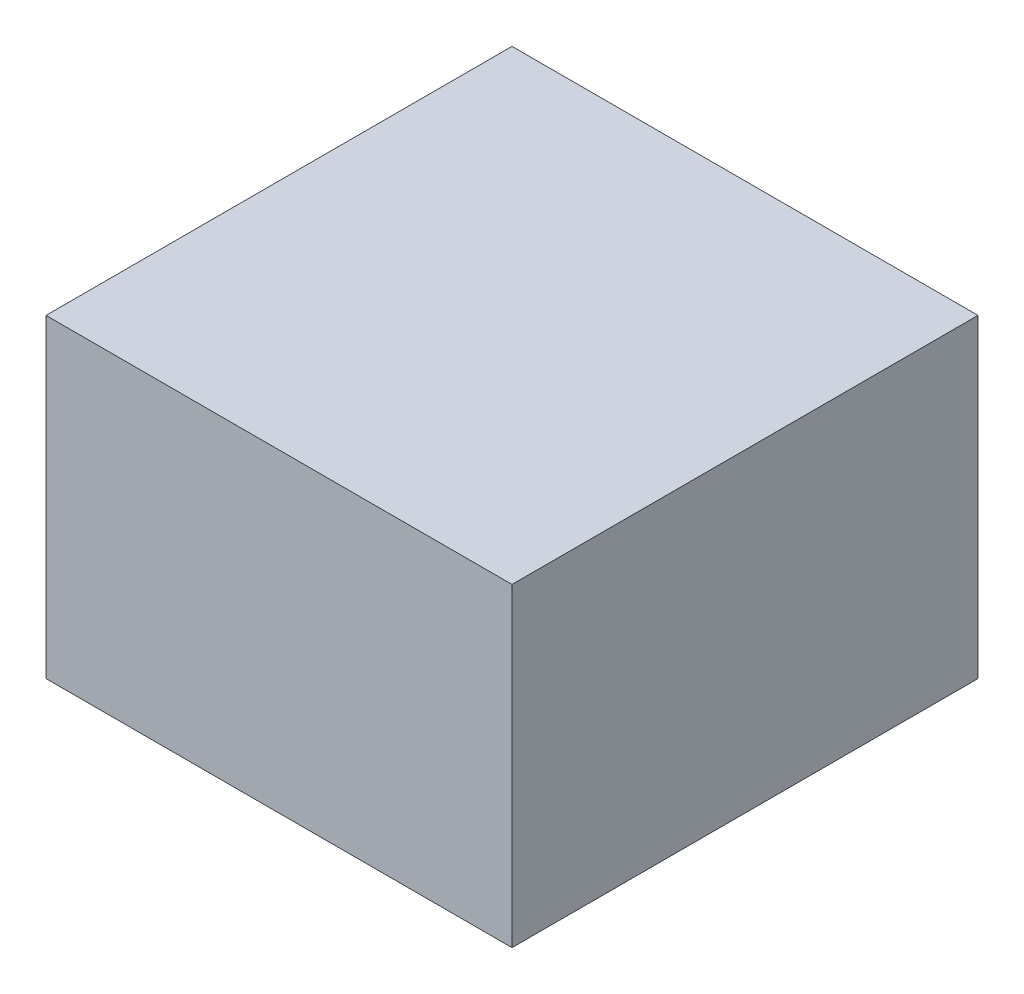
ISO-10303-21;
HEADER;
FILE_DESCRIPTION(('STEP AP214'),'2;1');
FILE_NAME('part.step','',(''),(''),'','','');
FILE_SCHEMA(('AUTOMOTIVE_DESIGN { 1 0 10303 214 1 1 1 1 }'));
ENDSEC;
DATA;
#1=APPLICATION_CONTEXT('core data for automotive mechanical design processes');
#2=APPLICATION_PROTOCOL_DEFINITION('international standard','automotive_design',2000,#1);
#3=PRODUCT_CONTEXT('',#1,'mechanical');
#4=PRODUCT('Part','Part','',(#3));
#5=PRODUCT_RELATED_PRODUCT_CATEGORY('part','',(#4));
#6=PRODUCT_DEFINITION_FORMATION('','',#4);
#7=PRODUCT_DEFINITION_CONTEXT('part definition',#1,'design');
#8=PRODUCT_DEFINITION('design','',#6,#7);
#9=PRODUCT_DEFINITION_SHAPE('','',#8);
#10=(LENGTH_UNIT() NAMED_UNIT(*) SI_UNIT(.MILLI.,.METRE.));
#11=(NAMED_UNIT(*) PLANE_ANGLE_UNIT() SI_UNIT($,.RADIAN.));
#12=(NAMED_UNIT(*) SI_UNIT($,.STERADIAN.) SOLID_ANGLE_UNIT());
#13=UNCERTAINTY_MEASURE_WITH_UNIT(LENGTH_MEASURE(1.E-05),#10,'distance_accuracy_value','');
#14=(GEOMETRIC_REPRESENTATION_CONTEXT(3) GLOBAL_UNCERTAINTY_ASSIGNED_CONTEXT((#13)) GLOBAL_UNIT_ASSIGNED_CONTEXT((#10,
#11,#12)) REPRESENTATION_CONTEXT('',''));
#15=CARTESIAN_POINT('',(0.,0.,0.));
#16=DIRECTION('',(0.,0.,1.));
#17=DIRECTION('',(1.,0.,0.));
#18=AXIS2_PLACEMENT_3D('',#15,#16,#17);
#19=CARTESIAN_POINT('',(-17.3023255813953,27.,-18.7906976744186));
#20=DIRECTION('',(1.,0.,0.));
#21=DIRECTION('',(0.,0.,-1.));
#22=AXIS2_PLACEMENT_3D('',#19,#20,#21);
#23=PLANE('',#22);
#24=DIRECTION('',(0.,0.,1.));
#25=VECTOR('',#24,1.);
#26=CARTESIAN_POINT('',(-17.3023255813953,0.,-18.7906976744186));
#27=LINE('',#26,#25);
#28=CARTESIAN_POINT('',(-17.3023255813953,0.,-18.7906976744186));
#29=VERTEX_POINT('',#28);
#30=CARTESIAN_POINT('',(-17.3023255813953,0.,21.2093023255814));
#31=VERTEX_POINT('',#30);
#32=EDGE_CURVE('E96',#29,#31,#27,.T.);
#33=ORIENTED_EDGE('',*,*,#32,.T.);
#34=DIRECTION('',(0.,-1.,0.));
#35=VECTOR('',#34,1.);
#36=CARTESIAN_POINT('',(-17.3023255813953,27.,21.2093023255814));
#37=LINE('',#36,#35);
#38=CARTESIAN_POINT('',(-17.3023255813953,27.,21.2093023255814));
#39=VERTEX_POINT('',#38);
#40=EDGE_CURVE('E11',#39,#31,#37,.T.);
#41=ORIENTED_EDGE('',*,*,#40,.F.);
#42=DIRECTION('',(0.,0.,1.));
#43=VECTOR('',#42,1.);
#44=CARTESIAN_POINT('',(-17.3023255813953,27.,-18.7906976744186));
#45=LINE('',#44,#43);
#46=CARTESIAN_POINT('',(-17.3023255813953,27.,-18.7906976744186));
#47=VERTEX_POINT('',#46);
#48=EDGE_CURVE('E84',#47,#39,#45,.T.);
#49=ORIENTED_EDGE('',*,*,#48,.F.);
#50=DIRECTION('',(0.,-1.,0.));
#51=VECTOR('',#50,1.);
#52=CARTESIAN_POINT('',(-17.3023255813953,27.,-18.7906976744186));
#53=LINE('',#52,#51);
#54=EDGE_CURVE('E92',#47,#29,#53,.T.);
#55=ORIENTED_EDGE('',*,*,#54,.T.);
#56=EDGE_LOOP('',(#33,#41,#49,#55));
#57=FACE_BOUND('',#56,.T.);
#58=ADVANCED_FACE('F33',(#57),#23,.F.);
#59=CARTESIAN_POINT('',(-17.3023255813953,27.,21.2093023255814));
#60=DIRECTION('',(0.,0.,-1.));
#61=DIRECTION('',(-1.,0.,0.));
#62=AXIS2_PLACEMENT_3D('',#59,#60,#61);
#63=PLANE('',#62);
#64=DIRECTION('',(1.,0.,0.));
#65=VECTOR('',#64,1.);
#66=CARTESIAN_POINT('',(-17.3023255813953,0.,21.2093023255814));
#67=LINE('',#66,#65);
#68=CARTESIAN_POINT('',(22.6976744186047,0.,21.2093023255814));
#69=VERTEX_POINT('',#68);
#70=EDGE_CURVE('E88',#31,#69,#67,.T.);
#71=ORIENTED_EDGE('',*,*,#70,.T.);
#72=DIRECTION('',(0.,-1.,0.));
#73=VECTOR('',#72,1.);
#74=CARTESIAN_POINT('',(22.6976744186047,27.,21.2093023255814));
#75=LINE('',#74,#73);
#76=CARTESIAN_POINT('',(22.6976744186047,27.,21.2093023255814));
#77=VERTEX_POINT('',#76);
#78=EDGE_CURVE('E41',#77,#69,#75,.T.);
#79=ORIENTED_EDGE('',*,*,#78,.F.);
#80=DIRECTION('',(1.,0.,0.));
#81=VECTOR('',#80,1.);
#82=CARTESIAN_POINT('',(-17.3023255813953,27.,21.2093023255814));
#83=LINE('',#82,#81);
#84=EDGE_CURVE('E79',#39,#77,#83,.T.);
#85=ORIENTED_EDGE('',*,*,#84,.F.);
#86=ORIENTED_EDGE('',*,*,#40,.T.);
#87=EDGE_LOOP('',(#71,#79,#85,#86));
#88=FACE_BOUND('',#87,.T.);
#89=ADVANCED_FACE('F87',(#88),#63,.F.);
#90=CARTESIAN_POINT('',(22.6976744186047,27.,-18.7906976744186));
#91=DIRECTION('',(-1.,0.,0.));
#92=DIRECTION('',(0.,0.,1.));
#93=AXIS2_PLACEMENT_3D('',#90,#91,#92);
#94=PLANE('',#93);
#95=DIRECTION('',(0.,0.,-1.));
#96=VECTOR('',#95,1.);
#97=CARTESIAN_POINT('',(22.6976744186047,0.,-18.7906976744186));
#98=LINE('',#97,#96);
#99=CARTESIAN_POINT('',(22.6976744186047,0.,-18.7906976744186));
#100=VERTEX_POINT('',#99);
#101=EDGE_CURVE('E66',#69,#100,#98,.T.);
#102=ORIENTED_EDGE('',*,*,#101,.T.);
#103=DIRECTION('',(0.,-1.,0.));
#104=VECTOR('',#103,1.);
#105=CARTESIAN_POINT('',(22.6976744186047,27.,-18.7906976744186));
#106=LINE('',#105,#104);
#107=CARTESIAN_POINT('',(22.6976744186047,27.,-18.7906976744186));
#108=VERTEX_POINT('',#107);
#109=EDGE_CURVE('E89',#108,#100,#106,.T.);
#110=ORIENTED_EDGE('',*,*,#109,.F.);
#111=DIRECTION('',(0.,0.,-1.));
#112=VECTOR('',#111,1.);
#113=CARTESIAN_POINT('',(22.6976744186047,27.,-18.7906976744186));
#114=LINE('',#113,#112);
#115=EDGE_CURVE('E82',#77,#108,#114,.T.);
#116=ORIENTED_EDGE('',*,*,#115,.F.);
#117=ORIENTED_EDGE('',*,*,#78,.T.);
#118=EDGE_LOOP('',(#102,#110,#116,#117));
#119=FACE_BOUND('',#118,.T.);
#120=ADVANCED_FACE('F90',(#119),#94,.F.);
#121=CARTESIAN_POINT('',(-17.3023255813953,27.,-18.7906976744186));
#122=DIRECTION('',(0.,0.,1.));
#123=DIRECTION('',(1.,0.,0.));
#124=AXIS2_PLACEMENT_3D('',#121,#122,#123);
#125=PLANE('',#124);
#126=DIRECTION('',(-1.,0.,0.));
#127=VECTOR('',#126,1.);
#128=CARTESIAN_POINT('',(-17.3023255813953,0.,-18.7906976744186));
#129=LINE('',#128,#127);
#130=EDGE_CURVE('E72',#100,#29,#129,.T.);
#131=ORIENTED_EDGE('',*,*,#130,.T.);
#132=ORIENTED_EDGE('',*,*,#54,.F.);
#133=DIRECTION('',(-1.,0.,0.));
#134=VECTOR('',#133,1.);
#135=CARTESIAN_POINT('',(-17.3023255813953,27.,-18.7906976744186));
#136=LINE('',#135,#134);
#137=EDGE_CURVE('E49',#108,#47,#136,.T.);
#138=ORIENTED_EDGE('',*,*,#137,.F.);
#139=ORIENTED_EDGE('',*,*,#109,.T.);
#140=EDGE_LOOP('',(#131,#132,#138,#139));
#141=FACE_BOUND('',#140,.T.);
#142=ADVANCED_FACE('F103',(#141),#125,.F.);
#143=CARTESIAN_POINT('',(0.,27.,0.));
#144=DIRECTION('',(0.,1.,0.));
#145=DIRECTION('',(0.,0.,1.));
#146=AXIS2_PLACEMENT_3D('',#143,#144,#145);
#147=PLANE('',#146);
#148=ORIENTED_EDGE('',*,*,#48,.T.);
#149=ORIENTED_EDGE('',*,*,#84,.T.);
#150=ORIENTED_EDGE('',*,*,#115,.T.);
#151=ORIENTED_EDGE('',*,*,#137,.T.);
#152=EDGE_LOOP('',(#148,#149,#150,#151));
#153=FACE_BOUND('',#152,.T.);
#154=ADVANCED_FACE('F80',(#153),#147,.T.);
#155=CARTESIAN_POINT('',(0.,0.,0.));
#156=DIRECTION('',(0.,1.,0.));
#157=DIRECTION('',(0.,0.,1.));
#158=AXIS2_PLACEMENT_3D('',#155,#156,#157);
#159=PLANE('',#158);
#160=ORIENTED_EDGE('',*,*,#32,.F.);
#161=ORIENTED_EDGE('',*,*,#130,.F.);
#162=ORIENTED_EDGE('',*,*,#101,.F.);
#163=ORIENTED_EDGE('',*,*,#70,.F.);
#164=EDGE_LOOP('',(#160,#161,#162,#163));
#165=FACE_BOUND('',#164,.T.);
#166=ADVANCED_FACE('F106',(#165),#159,.F.);
#167=CLOSED_SHELL('',(#58,#89,#120,#142,#154,#166));
#168=MANIFOLD_SOLID_BREP('B2',#167);
#169=ADVANCED_BREP_SHAPE_REPRESENTATION('',(#18,#168),#14);
#170=SHAPE_DEFINITION_REPRESENTATION(#9,#169);
ENDSEC;
END-ISO-10303-21;
